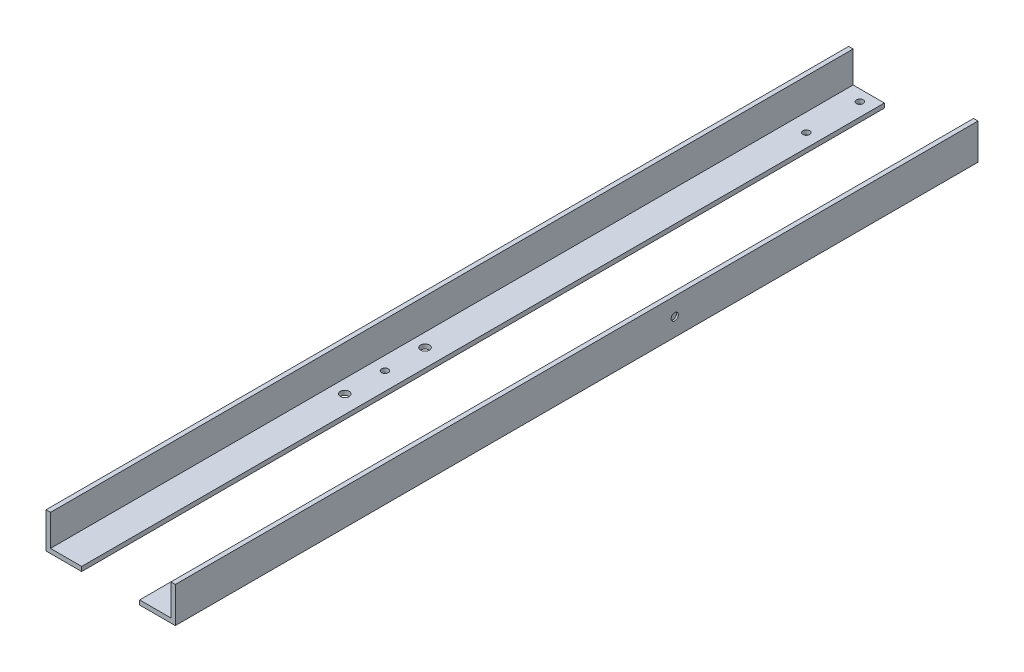
ISO-10303-21;
HEADER;
FILE_DESCRIPTION(('STEP AP214'),'2;1');
FILE_NAME('part.step','',(''),(''),'','','');
FILE_SCHEMA(('AUTOMOTIVE_DESIGN { 1 0 10303 214 1 1 1 1 }'));
ENDSEC;
DATA;
#1=APPLICATION_CONTEXT('core data for automotive mechanical design processes');
#2=APPLICATION_PROTOCOL_DEFINITION('international standard','automotive_design',2000,#1);
#3=PRODUCT_CONTEXT('',#1,'mechanical');
#4=PRODUCT('Part','Part','',(#3));
#5=PRODUCT_RELATED_PRODUCT_CATEGORY('part','',(#4));
#6=PRODUCT_DEFINITION_FORMATION('','',#4);
#7=PRODUCT_DEFINITION_CONTEXT('part definition',#1,'design');
#8=PRODUCT_DEFINITION('design','',#6,#7);
#9=PRODUCT_DEFINITION_SHAPE('','',#8);
#10=(LENGTH_UNIT() NAMED_UNIT(*) SI_UNIT(.MILLI.,.METRE.));
#11=(NAMED_UNIT(*) PLANE_ANGLE_UNIT() SI_UNIT($,.RADIAN.));
#12=(NAMED_UNIT(*) SI_UNIT($,.STERADIAN.) SOLID_ANGLE_UNIT());
#13=UNCERTAINTY_MEASURE_WITH_UNIT(LENGTH_MEASURE(1.E-05),#10,'distance_accuracy_value','');
#14=(GEOMETRIC_REPRESENTATION_CONTEXT(3) GLOBAL_UNCERTAINTY_ASSIGNED_CONTEXT((#13)) GLOBAL_UNIT_ASSIGNED_CONTEXT((#10,
#11,#12)) REPRESENTATION_CONTEXT('',''));
#15=CARTESIAN_POINT('',(0.,0.,0.));
#16=DIRECTION('',(0.,0.,1.));
#17=DIRECTION('',(1.,0.,0.));
#18=AXIS2_PLACEMENT_3D('',#15,#16,#17);
#19=CARTESIAN_POINT('',(-92.075,50.8,-571.5));
#20=DIRECTION('',(0.,0.,1.));
#21=DIRECTION('',(1.,0.,0.));
#22=AXIS2_PLACEMENT_3D('',#19,#20,#21);
#23=PLANE('',#22);
#24=DIRECTION('',(1.,0.,0.));
#25=VECTOR('',#24,1.);
#26=CARTESIAN_POINT('',(41.275,6.35,-571.5));
#27=LINE('',#26,#25);
#28=CARTESIAN_POINT('',(41.275,6.35,-571.5));
#29=VERTEX_POINT('',#28);
#30=CARTESIAN_POINT('',(85.725,6.35,-571.5));
#31=VERTEX_POINT('',#30);
#32=EDGE_CURVE('E141',#29,#31,#27,.T.);
#33=ORIENTED_EDGE('',*,*,#32,.T.);
#34=DIRECTION('',(0.,1.,0.));
#35=VECTOR('',#34,1.);
#36=CARTESIAN_POINT('',(85.725,50.8,-571.5));
#37=LINE('',#36,#35);
#38=CARTESIAN_POINT('',(85.725,50.8,-571.5));
#39=VERTEX_POINT('',#38);
#40=EDGE_CURVE('E137',#31,#39,#37,.T.);
#41=ORIENTED_EDGE('',*,*,#40,.T.);
#42=DIRECTION('',(-1.,0.,0.));
#43=VECTOR('',#42,1.);
#44=CARTESIAN_POINT('',(-92.075,50.8,-571.5));
#45=LINE('',#44,#43);
#46=CARTESIAN_POINT('',(92.075,50.8,-571.5));
#47=VERTEX_POINT('',#46);
#48=EDGE_CURVE('E116',#47,#39,#45,.T.);
#49=ORIENTED_EDGE('',*,*,#48,.F.);
#50=DIRECTION('',(0.,-1.,0.));
#51=VECTOR('',#50,1.);
#52=CARTESIAN_POINT('',(92.075,50.8,-571.5));
#53=LINE('',#52,#51);
#54=CARTESIAN_POINT('',(92.075,0.,-571.5));
#55=VERTEX_POINT('',#54);
#56=EDGE_CURVE('E140',#47,#55,#53,.T.);
#57=ORIENTED_EDGE('',*,*,#56,.T.);
#58=DIRECTION('',(-1.,0.,0.));
#59=VECTOR('',#58,1.);
#60=CARTESIAN_POINT('',(-92.075,0.,-571.5));
#61=LINE('',#60,#59);
#62=CARTESIAN_POINT('',(41.275,0.,-571.5));
#63=VERTEX_POINT('',#62);
#64=EDGE_CURVE('E48',#55,#63,#61,.T.);
#65=ORIENTED_EDGE('',*,*,#64,.T.);
#66=DIRECTION('',(0.,1.,0.));
#67=VECTOR('',#66,1.);
#68=CARTESIAN_POINT('',(41.275,6.35,-571.5));
#69=LINE('',#68,#67);
#70=EDGE_CURVE('E109',#63,#29,#69,.T.);
#71=ORIENTED_EDGE('',*,*,#70,.T.);
#72=EDGE_LOOP('',(#33,#41,#49,#57,#65,#71));
#73=FACE_BOUND('',#72,.T.);
#74=ADVANCED_FACE('F45',(#73),#23,.F.);
#75=CARTESIAN_POINT('',(-92.075,50.8,571.5));
#76=DIRECTION('',(0.,0.,-1.));
#77=DIRECTION('',(-1.,0.,0.));
#78=AXIS2_PLACEMENT_3D('',#75,#76,#77);
#79=PLANE('',#78);
#80=DIRECTION('',(1.,0.,0.));
#81=VECTOR('',#80,1.);
#82=CARTESIAN_POINT('',(-92.075,50.8,571.5));
#83=LINE('',#82,#81);
#84=CARTESIAN_POINT('',(85.725,50.8,571.5));
#85=VERTEX_POINT('',#84);
#86=CARTESIAN_POINT('',(92.075,50.8,571.5));
#87=VERTEX_POINT('',#86);
#88=EDGE_CURVE('E125',#85,#87,#83,.T.);
#89=ORIENTED_EDGE('',*,*,#88,.F.);
#90=DIRECTION('',(0.,1.,0.));
#91=VECTOR('',#90,1.);
#92=CARTESIAN_POINT('',(85.725,50.8,571.5));
#93=LINE('',#92,#91);
#94=CARTESIAN_POINT('',(85.725,6.35,571.5));
#95=VERTEX_POINT('',#94);
#96=EDGE_CURVE('E124',#95,#85,#93,.T.);
#97=ORIENTED_EDGE('',*,*,#96,.F.);
#98=DIRECTION('',(1.,0.,0.));
#99=VECTOR('',#98,1.);
#100=CARTESIAN_POINT('',(41.275,6.35,571.5));
#101=LINE('',#100,#99);
#102=CARTESIAN_POINT('',(41.275,6.35,571.5));
#103=VERTEX_POINT('',#102);
#104=EDGE_CURVE('E129',#103,#95,#101,.T.);
#105=ORIENTED_EDGE('',*,*,#104,.F.);
#106=DIRECTION('',(0.,1.,0.));
#107=VECTOR('',#106,1.);
#108=CARTESIAN_POINT('',(41.275,6.35,571.5));
#109=LINE('',#108,#107);
#110=CARTESIAN_POINT('',(41.275,0.,571.5));
#111=VERTEX_POINT('',#110);
#112=EDGE_CURVE('E54',#111,#103,#109,.T.);
#113=ORIENTED_EDGE('',*,*,#112,.F.);
#114=DIRECTION('',(1.,0.,0.));
#115=VECTOR('',#114,1.);
#116=CARTESIAN_POINT('',(-92.075,0.,571.5));
#117=LINE('',#116,#115);
#118=CARTESIAN_POINT('',(92.075,0.,571.5));
#119=VERTEX_POINT('',#118);
#120=EDGE_CURVE('E99',#111,#119,#117,.T.);
#121=ORIENTED_EDGE('',*,*,#120,.T.);
#122=DIRECTION('',(0.,-1.,0.));
#123=VECTOR('',#122,1.);
#124=CARTESIAN_POINT('',(92.075,50.8,571.5));
#125=LINE('',#124,#123);
#126=EDGE_CURVE('E103',#87,#119,#125,.T.);
#127=ORIENTED_EDGE('',*,*,#126,.F.);
#128=EDGE_LOOP('',(#89,#97,#105,#113,#121,#127));
#129=FACE_BOUND('',#128,.T.);
#130=ADVANCED_FACE('F102',(#129),#79,.F.);
#131=CARTESIAN_POINT('',(0.,0.,0.));
#132=DIRECTION('',(0.,-1.,0.));
#133=DIRECTION('',(0.,0.,-1.));
#134=AXIS2_PLACEMENT_3D('',#131,#132,#133);
#135=PLANE('',#134);
#136=CARTESIAN_POINT('',(60.325,0.,-555.625));
#137=DIRECTION('',(0.,1.,0.));
#138=DIRECTION('',(0.,0.,1.));
#139=AXIS2_PLACEMENT_3D('',#136,#137,#138);
#140=CIRCLE('',#139,4.76250000000001);
#141=CARTESIAN_POINT('',(60.325,0.,-550.8625));
#142=VERTEX_POINT('',#141);
#143=EDGE_CURVE('E144',#142,#142,#140,.T.);
#144=ORIENTED_EDGE('',*,*,#143,.T.);
#145=EDGE_LOOP('',(#144));
#146=FACE_BOUND('',#145,.T.);
#147=CARTESIAN_POINT('',(60.325,0.,-479.425));
#148=DIRECTION('',(0.,1.,0.));
#149=DIRECTION('',(0.,0.,1.));
#150=AXIS2_PLACEMENT_3D('',#147,#148,#149);
#151=CIRCLE('',#150,4.7625);
#152=CARTESIAN_POINT('',(60.325,0.,-474.6625));
#153=VERTEX_POINT('',#152);
#154=EDGE_CURVE('E290',#153,#153,#151,.T.);
#155=ORIENTED_EDGE('',*,*,#154,.T.);
#156=EDGE_LOOP('',(#155));
#157=FACE_BOUND('',#156,.T.);
#158=CARTESIAN_POINT('',(60.325,0.,114.3));
#159=DIRECTION('',(0.,1.,0.));
#160=DIRECTION('',(0.,0.,1.));
#161=AXIS2_PLACEMENT_3D('',#158,#159,#160);
#162=CIRCLE('',#161,4.7625);
#163=CARTESIAN_POINT('',(60.325,0.,119.0625));
#164=VERTEX_POINT('',#163);
#165=EDGE_CURVE('E296',#164,#164,#162,.T.);
#166=ORIENTED_EDGE('',*,*,#165,.T.);
#167=EDGE_LOOP('',(#166));
#168=FACE_BOUND('',#167,.T.);
#169=CARTESIAN_POINT('',(60.325,0.,57.15));
#170=DIRECTION('',(0.,1.,0.));
#171=DIRECTION('',(0.,0.,1.));
#172=AXIS2_PLACEMENT_3D('',#169,#170,#171);
#173=CIRCLE('',#172,6.35);
#174=CARTESIAN_POINT('',(60.325,0.,63.5));
#175=VERTEX_POINT('',#174);
#176=EDGE_CURVE('E302',#175,#175,#173,.T.);
#177=ORIENTED_EDGE('',*,*,#176,.T.);
#178=EDGE_LOOP('',(#177));
#179=FACE_BOUND('',#178,.T.);
#180=CARTESIAN_POINT('',(60.325,0.,171.45));
#181=DIRECTION('',(0.,1.,0.));
#182=DIRECTION('',(0.,0.,1.));
#183=AXIS2_PLACEMENT_3D('',#180,#181,#182);
#184=CIRCLE('',#183,6.34999999999999);
#185=CARTESIAN_POINT('',(60.325,0.,177.8));
#186=VERTEX_POINT('',#185);
#187=EDGE_CURVE('E280',#186,#186,#184,.T.);
#188=ORIENTED_EDGE('',*,*,#187,.T.);
#189=EDGE_LOOP('',(#188));
#190=FACE_BOUND('',#189,.T.);
#191=DIRECTION('',(0.,0.,1.));
#192=VECTOR('',#191,1.);
#193=CARTESIAN_POINT('',(41.275,0.,-571.5));
#194=LINE('',#193,#192);
#195=EDGE_CURVE('E12',#63,#111,#194,.T.);
#196=ORIENTED_EDGE('',*,*,#195,.F.);
#197=ORIENTED_EDGE('',*,*,#64,.F.);
#198=DIRECTION('',(0.,0.,-1.));
#199=VECTOR('',#198,1.);
#200=CARTESIAN_POINT('',(92.075,0.,571.5));
#201=LINE('',#200,#199);
#202=EDGE_CURVE('E108',#119,#55,#201,.T.);
#203=ORIENTED_EDGE('',*,*,#202,.F.);
#204=ORIENTED_EDGE('',*,*,#120,.F.);
#205=EDGE_LOOP('',(#196,#197,#203,#204));
#206=FACE_BOUND('',#205,.T.);
#207=ADVANCED_FACE('F118',(#146,#157,#168,#179,#190,#206),#135,.T.);
#208=CARTESIAN_POINT('',(92.075,50.8,571.5));
#209=DIRECTION('',(-1.,0.,0.));
#210=DIRECTION('',(0.,0.,1.));
#211=AXIS2_PLACEMENT_3D('',#208,#209,#210);
#212=PLANE('',#211);
#213=CARTESIAN_POINT('',(92.075,25.4,-139.7));
#214=DIRECTION('',(1.,0.,0.));
#215=DIRECTION('',(0.,0.,-1.));
#216=AXIS2_PLACEMENT_3D('',#213,#214,#215);
#217=CIRCLE('',#216,5.13079999999997);
#218=CARTESIAN_POINT('',(92.075,25.4,-144.8308));
#219=VERTEX_POINT('',#218);
#220=EDGE_CURVE('E277',#219,#219,#217,.T.);
#221=ORIENTED_EDGE('',*,*,#220,.F.);
#222=EDGE_LOOP('',(#221));
#223=FACE_BOUND('',#222,.T.);
#224=ORIENTED_EDGE('',*,*,#202,.T.);
#225=ORIENTED_EDGE('',*,*,#56,.F.);
#226=DIRECTION('',(0.,0.,-1.));
#227=VECTOR('',#226,1.);
#228=CARTESIAN_POINT('',(92.075,50.8,571.5));
#229=LINE('',#228,#227);
#230=EDGE_CURVE('E115',#87,#47,#229,.T.);
#231=ORIENTED_EDGE('',*,*,#230,.F.);
#232=ORIENTED_EDGE('',*,*,#126,.T.);
#233=EDGE_LOOP('',(#224,#225,#231,#232));
#234=FACE_BOUND('',#233,.T.);
#235=ADVANCED_FACE('F112',(#223,#234),#212,.F.);
#236=CARTESIAN_POINT('',(0.,50.8,0.));
#237=DIRECTION('',(0.,-1.,0.));
#238=DIRECTION('',(0.,0.,-1.));
#239=AXIS2_PLACEMENT_3D('',#236,#237,#238);
#240=PLANE('',#239);
#241=ORIENTED_EDGE('',*,*,#48,.T.);
#242=DIRECTION('',(0.,0.,1.));
#243=VECTOR('',#242,1.);
#244=CARTESIAN_POINT('',(85.725,50.8,-571.5));
#245=LINE('',#244,#243);
#246=EDGE_CURVE('E131',#39,#85,#245,.T.);
#247=ORIENTED_EDGE('',*,*,#246,.T.);
#248=ORIENTED_EDGE('',*,*,#88,.T.);
#249=ORIENTED_EDGE('',*,*,#230,.T.);
#250=EDGE_LOOP('',(#241,#247,#248,#249));
#251=FACE_BOUND('',#250,.T.);
#252=ADVANCED_FACE('F150',(#251),#240,.F.);
#253=CARTESIAN_POINT('',(85.725,50.8,-571.5));
#254=DIRECTION('',(1.,0.,0.));
#255=DIRECTION('',(0.,1.,0.));
#256=AXIS2_PLACEMENT_3D('',#253,#254,#255);
#257=PLANE('',#256);
#258=ORIENTED_EDGE('',*,*,#96,.T.);
#259=ORIENTED_EDGE('',*,*,#246,.F.);
#260=ORIENTED_EDGE('',*,*,#40,.F.);
#261=DIRECTION('',(0.,0.,1.));
#262=VECTOR('',#261,1.);
#263=CARTESIAN_POINT('',(85.725,6.35,-571.5));
#264=LINE('',#263,#262);
#265=EDGE_CURVE('E78',#31,#95,#264,.T.);
#266=ORIENTED_EDGE('',*,*,#265,.T.);
#267=EDGE_LOOP('',(#258,#259,#260,#266));
#268=FACE_BOUND('',#267,.T.);
#269=ADVANCED_FACE('F152',(#268),#257,.F.);
#270=CARTESIAN_POINT('',(41.275,6.35,-571.5));
#271=DIRECTION('',(0.,-1.,0.));
#272=DIRECTION('',(0.,0.,-1.));
#273=AXIS2_PLACEMENT_3D('',#270,#271,#272);
#274=PLANE('',#273);
#275=CARTESIAN_POINT('',(60.325,6.35,-555.625));
#276=DIRECTION('',(0.,1.,0.));
#277=DIRECTION('',(0.,0.,1.));
#278=AXIS2_PLACEMENT_3D('',#275,#276,#277);
#279=CIRCLE('',#278,4.76250000000001);
#280=CARTESIAN_POINT('',(60.325,6.35,-550.8625));
#281=VERTEX_POINT('',#280);
#282=EDGE_CURVE('E287',#281,#281,#279,.T.);
#283=ORIENTED_EDGE('',*,*,#282,.F.);
#284=EDGE_LOOP('',(#283));
#285=FACE_BOUND('',#284,.T.);
#286=CARTESIAN_POINT('',(60.325,6.35,-479.425));
#287=DIRECTION('',(0.,1.,0.));
#288=DIRECTION('',(0.,0.,1.));
#289=AXIS2_PLACEMENT_3D('',#286,#287,#288);
#290=CIRCLE('',#289,4.7625);
#291=CARTESIAN_POINT('',(60.325,6.35,-474.6625));
#292=VERTEX_POINT('',#291);
#293=EDGE_CURVE('E293',#292,#292,#290,.T.);
#294=ORIENTED_EDGE('',*,*,#293,.F.);
#295=EDGE_LOOP('',(#294));
#296=FACE_BOUND('',#295,.T.);
#297=CARTESIAN_POINT('',(60.325,6.35,114.3));
#298=DIRECTION('',(0.,1.,0.));
#299=DIRECTION('',(0.,0.,1.));
#300=AXIS2_PLACEMENT_3D('',#297,#298,#299);
#301=CIRCLE('',#300,4.7625);
#302=CARTESIAN_POINT('',(60.325,6.35,119.0625));
#303=VERTEX_POINT('',#302);
#304=EDGE_CURVE('E299',#303,#303,#301,.T.);
#305=ORIENTED_EDGE('',*,*,#304,.F.);
#306=EDGE_LOOP('',(#305));
#307=FACE_BOUND('',#306,.T.);
#308=CARTESIAN_POINT('',(60.325,6.35,57.15));
#309=DIRECTION('',(0.,1.,0.));
#310=DIRECTION('',(0.,0.,1.));
#311=AXIS2_PLACEMENT_3D('',#308,#309,#310);
#312=CIRCLE('',#311,6.35);
#313=CARTESIAN_POINT('',(60.325,6.35,63.5));
#314=VERTEX_POINT('',#313);
#315=EDGE_CURVE('E305',#314,#314,#312,.T.);
#316=ORIENTED_EDGE('',*,*,#315,.F.);
#317=EDGE_LOOP('',(#316));
#318=FACE_BOUND('',#317,.T.);
#319=CARTESIAN_POINT('',(60.325,6.35,171.45));
#320=DIRECTION('',(0.,1.,0.));
#321=DIRECTION('',(0.,0.,1.));
#322=AXIS2_PLACEMENT_3D('',#319,#320,#321);
#323=CIRCLE('',#322,6.34999999999999);
#324=CARTESIAN_POINT('',(60.325,6.35,177.8));
#325=VERTEX_POINT('',#324);
#326=EDGE_CURVE('E276',#325,#325,#323,.T.);
#327=ORIENTED_EDGE('',*,*,#326,.F.);
#328=EDGE_LOOP('',(#327));
#329=FACE_BOUND('',#328,.T.);
#330=ORIENTED_EDGE('',*,*,#104,.T.);
#331=ORIENTED_EDGE('',*,*,#265,.F.);
#332=ORIENTED_EDGE('',*,*,#32,.F.);
#333=DIRECTION('',(0.,0.,1.));
#334=VECTOR('',#333,1.);
#335=CARTESIAN_POINT('',(41.275,6.35,-571.5));
#336=LINE('',#335,#334);
#337=EDGE_CURVE('E127',#29,#103,#336,.T.);
#338=ORIENTED_EDGE('',*,*,#337,.T.);
#339=EDGE_LOOP('',(#330,#331,#332,#338));
#340=FACE_BOUND('',#339,.T.);
#341=ADVANCED_FACE('F154',(#285,#296,#307,#318,#329,#340),#274,.F.);
#342=CARTESIAN_POINT('',(41.275,6.35,-571.5));
#343=DIRECTION('',(1.,0.,0.));
#344=DIRECTION('',(0.,0.,-1.));
#345=AXIS2_PLACEMENT_3D('',#342,#343,#344);
#346=PLANE('',#345);
#347=ORIENTED_EDGE('',*,*,#112,.T.);
#348=ORIENTED_EDGE('',*,*,#337,.F.);
#349=ORIENTED_EDGE('',*,*,#70,.F.);
#350=ORIENTED_EDGE('',*,*,#195,.T.);
#351=EDGE_LOOP('',(#347,#348,#349,#350));
#352=FACE_BOUND('',#351,.T.);
#353=ADVANCED_FACE('F156',(#352),#346,.F.);
#354=CARTESIAN_POINT('',(60.325,0.,171.45));
#355=DIRECTION('',(0.,1.,0.));
#356=DIRECTION('',(0.,0.,1.));
#357=AXIS2_PLACEMENT_3D('',#354,#355,#356);
#358=CYLINDRICAL_SURFACE('',#357,6.34999999999999);
#359=ORIENTED_EDGE('',*,*,#187,.F.);
#360=EDGE_LOOP('',(#359));
#361=FACE_BOUND('',#360,.T.);
#362=ORIENTED_EDGE('',*,*,#326,.T.);
#363=EDGE_LOOP('',(#362));
#364=FACE_BOUND('',#363,.T.);
#365=ADVANCED_FACE('F158',(#361,#364),#358,.F.);
#366=CARTESIAN_POINT('',(60.325,0.,57.15));
#367=DIRECTION('',(0.,1.,0.));
#368=DIRECTION('',(0.,0.,1.));
#369=AXIS2_PLACEMENT_3D('',#366,#367,#368);
#370=CYLINDRICAL_SURFACE('',#369,6.35);
#371=ORIENTED_EDGE('',*,*,#176,.F.);
#372=EDGE_LOOP('',(#371));
#373=FACE_BOUND('',#372,.T.);
#374=ORIENTED_EDGE('',*,*,#315,.T.);
#375=EDGE_LOOP('',(#374));
#376=FACE_BOUND('',#375,.T.);
#377=ADVANCED_FACE('F164',(#373,#376),#370,.F.);
#378=CARTESIAN_POINT('',(60.325,0.,114.3));
#379=DIRECTION('',(0.,1.,0.));
#380=DIRECTION('',(0.,0.,1.));
#381=AXIS2_PLACEMENT_3D('',#378,#379,#380);
#382=CYLINDRICAL_SURFACE('',#381,4.7625);
#383=ORIENTED_EDGE('',*,*,#165,.F.);
#384=EDGE_LOOP('',(#383));
#385=FACE_BOUND('',#384,.T.);
#386=ORIENTED_EDGE('',*,*,#304,.T.);
#387=EDGE_LOOP('',(#386));
#388=FACE_BOUND('',#387,.T.);
#389=ADVANCED_FACE('F211',(#385,#388),#382,.F.);
#390=CARTESIAN_POINT('',(60.325,0.,-479.425));
#391=DIRECTION('',(0.,1.,0.));
#392=DIRECTION('',(0.,0.,1.));
#393=AXIS2_PLACEMENT_3D('',#390,#391,#392);
#394=CYLINDRICAL_SURFACE('',#393,4.7625);
#395=ORIENTED_EDGE('',*,*,#154,.F.);
#396=EDGE_LOOP('',(#395));
#397=FACE_BOUND('',#396,.T.);
#398=ORIENTED_EDGE('',*,*,#293,.T.);
#399=EDGE_LOOP('',(#398));
#400=FACE_BOUND('',#399,.T.);
#401=ADVANCED_FACE('F221',(#397,#400),#394,.F.);
#402=CARTESIAN_POINT('',(60.325,0.,-555.625));
#403=DIRECTION('',(0.,1.,0.));
#404=DIRECTION('',(0.,0.,1.));
#405=AXIS2_PLACEMENT_3D('',#402,#403,#404);
#406=CYLINDRICAL_SURFACE('',#405,4.76250000000001);
#407=ORIENTED_EDGE('',*,*,#143,.F.);
#408=EDGE_LOOP('',(#407));
#409=FACE_BOUND('',#408,.T.);
#410=ORIENTED_EDGE('',*,*,#282,.T.);
#411=EDGE_LOOP('',(#410));
#412=FACE_BOUND('',#411,.T.);
#413=ADVANCED_FACE('F231',(#409,#412),#406,.F.);
#414=CARTESIAN_POINT('',(89.535,25.4,-139.7));
#415=DIRECTION('',(1.,0.,0.));
#416=DIRECTION('',(0.,0.,-1.));
#417=AXIS2_PLACEMENT_3D('',#414,#415,#416);
#418=CYLINDRICAL_SURFACE('',#417,5.13079999999997);
#419=CARTESIAN_POINT('',(89.535,25.4,-139.7));
#420=DIRECTION('',(1.,0.,0.));
#421=DIRECTION('',(0.,0.,-1.));
#422=AXIS2_PLACEMENT_3D('',#419,#420,#421);
#423=CIRCLE('',#422,5.13079999999997);
#424=CARTESIAN_POINT('',(89.535,25.4,-144.8308));
#425=VERTEX_POINT('',#424);
#426=EDGE_CURVE('E275',#425,#425,#423,.T.);
#427=ORIENTED_EDGE('',*,*,#426,.F.);
#428=EDGE_LOOP('',(#427));
#429=FACE_BOUND('',#428,.T.);
#430=ORIENTED_EDGE('',*,*,#220,.T.);
#431=EDGE_LOOP('',(#430));
#432=FACE_BOUND('',#431,.T.);
#433=ADVANCED_FACE('F241',(#429,#432),#418,.F.);
#434=CARTESIAN_POINT('',(89.535,25.4,-139.7));
#435=DIRECTION('',(1.,0.,0.));
#436=DIRECTION('',(0.,0.,-1.));
#437=AXIS2_PLACEMENT_3D('',#434,#435,#436);
#438=PLANE('',#437);
#439=ORIENTED_EDGE('',*,*,#426,.T.);
#440=EDGE_LOOP('',(#439));
#441=FACE_BOUND('',#440,.T.);
#442=ADVANCED_FACE('F259',(#441),#438,.T.);
#443=CLOSED_SHELL('',(#74,#130,#207,#235,#252,#269,#341,#353,#365,#377,#389,#401,#413,#433,#442));
#444=MANIFOLD_SOLID_BREP('B2',#443);
#445=CARTESIAN_POINT('',(-92.075,50.8,571.5));
#446=DIRECTION('',(1.,0.,0.));
#447=DIRECTION('',(0.,0.,-1.));
#448=AXIS2_PLACEMENT_3D('',#445,#446,#447);
#449=PLANE('',#448);
#450=DIRECTION('',(0.,0.,1.));
#451=VECTOR('',#450,1.);
#452=CARTESIAN_POINT('',(-92.075,0.,571.5));
#453=LINE('',#452,#451);
#454=CARTESIAN_POINT('',(-92.075,0.,-571.5));
#455=VERTEX_POINT('',#454);
#456=CARTESIAN_POINT('',(-92.075,0.,571.5));
#457=VERTEX_POINT('',#456);
#458=EDGE_CURVE('E392',#455,#457,#453,.T.);
#459=ORIENTED_EDGE('',*,*,#458,.T.);
#460=DIRECTION('',(0.,-1.,0.));
#461=VECTOR('',#460,1.);
#462=CARTESIAN_POINT('',(-92.075,50.8,571.5));
#463=LINE('',#462,#461);
#464=CARTESIAN_POINT('',(-92.075,50.8,571.5));
#465=VERTEX_POINT('',#464);
#466=EDGE_CURVE('E364',#465,#457,#463,.T.);
#467=ORIENTED_EDGE('',*,*,#466,.F.);
#468=DIRECTION('',(0.,0.,1.));
#469=VECTOR('',#468,1.);
#470=CARTESIAN_POINT('',(-92.075,50.8,571.5));
#471=LINE('',#470,#469);
#472=CARTESIAN_POINT('',(-92.075,50.8,-571.5));
#473=VERTEX_POINT('',#472);
#474=EDGE_CURVE('E380',#473,#465,#471,.T.);
#475=ORIENTED_EDGE('',*,*,#474,.F.);
#476=DIRECTION('',(0.,-1.,0.));
#477=VECTOR('',#476,1.);
#478=CARTESIAN_POINT('',(-92.075,50.8,-571.5));
#479=LINE('',#478,#477);
#480=EDGE_CURVE('E43',#473,#455,#479,.T.);
#481=ORIENTED_EDGE('',*,*,#480,.T.);
#482=EDGE_LOOP('',(#459,#467,#475,#481));
#483=FACE_BOUND('',#482,.T.);
#484=ADVANCED_FACE('F356',(#483),#449,.F.);
#485=CARTESIAN_POINT('',(0.,0.,0.));
#486=DIRECTION('',(0.,-1.,0.));
#487=DIRECTION('',(0.,0.,-1.));
#488=AXIS2_PLACEMENT_3D('',#485,#486,#487);
#489=PLANE('',#488);
#490=CARTESIAN_POINT('',(-60.325,0.,-555.625));
#491=DIRECTION('',(0.,1.,0.));
#492=DIRECTION('',(0.,0.,1.));
#493=AXIS2_PLACEMENT_3D('',#490,#491,#492);
#494=CIRCLE('',#493,4.76250000000002);
#495=CARTESIAN_POINT('',(-60.325,0.,-550.8625));
#496=VERTEX_POINT('',#495);
#497=EDGE_CURVE('E435',#496,#496,#494,.T.);
#498=ORIENTED_EDGE('',*,*,#497,.T.);
#499=EDGE_LOOP('',(#498));
#500=FACE_BOUND('',#499,.T.);
#501=CARTESIAN_POINT('',(-60.325,0.,-479.425));
#502=DIRECTION('',(0.,1.,0.));
#503=DIRECTION('',(0.,0.,1.));
#504=AXIS2_PLACEMENT_3D('',#501,#502,#503);
#505=CIRCLE('',#504,4.7625);
#506=CARTESIAN_POINT('',(-60.325,0.,-474.6625));
#507=VERTEX_POINT('',#506);
#508=EDGE_CURVE('E464',#507,#507,#505,.T.);
#509=ORIENTED_EDGE('',*,*,#508,.T.);
#510=EDGE_LOOP('',(#509));
#511=FACE_BOUND('',#510,.T.);
#512=CARTESIAN_POINT('',(-66.675,0.,114.3));
#513=DIRECTION('',(0.,1.,0.));
#514=DIRECTION('',(0.,0.,1.));
#515=AXIS2_PLACEMENT_3D('',#512,#513,#514);
#516=CIRCLE('',#515,4.7625);
#517=CARTESIAN_POINT('',(-66.675,0.,119.0625));
#518=VERTEX_POINT('',#517);
#519=EDGE_CURVE('E458',#518,#518,#516,.T.);
#520=ORIENTED_EDGE('',*,*,#519,.T.);
#521=EDGE_LOOP('',(#520));
#522=FACE_BOUND('',#521,.T.);
#523=CARTESIAN_POINT('',(-66.675,0.,57.15));
#524=DIRECTION('',(0.,1.,0.));
#525=DIRECTION('',(0.,0.,1.));
#526=AXIS2_PLACEMENT_3D('',#523,#524,#525);
#527=CIRCLE('',#526,6.35);
#528=CARTESIAN_POINT('',(-66.675,0.,63.5));
#529=VERTEX_POINT('',#528);
#530=EDGE_CURVE('E452',#529,#529,#527,.T.);
#531=ORIENTED_EDGE('',*,*,#530,.T.);
#532=EDGE_LOOP('',(#531));
#533=FACE_BOUND('',#532,.T.);
#534=CARTESIAN_POINT('',(-66.675,0.,171.45));
#535=DIRECTION('',(0.,1.,0.));
#536=DIRECTION('',(0.,0.,1.));
#537=AXIS2_PLACEMENT_3D('',#534,#535,#536);
#538=CIRCLE('',#537,6.35);
#539=CARTESIAN_POINT('',(-66.675,0.,177.8));
#540=VERTEX_POINT('',#539);
#541=EDGE_CURVE('E446',#540,#540,#538,.T.);
#542=ORIENTED_EDGE('',*,*,#541,.T.);
#543=EDGE_LOOP('',(#542));
#544=FACE_BOUND('',#543,.T.);
#545=DIRECTION('',(0.,0.,1.));
#546=VECTOR('',#545,1.);
#547=CARTESIAN_POINT('',(-41.275,0.,-571.5));
#548=LINE('',#547,#546);
#549=CARTESIAN_POINT('',(-41.275,0.,-571.5));
#550=VERTEX_POINT('',#549);
#551=CARTESIAN_POINT('',(-41.275,0.,571.5));
#552=VERTEX_POINT('',#551);
#553=EDGE_CURVE('E409',#550,#552,#548,.T.);
#554=ORIENTED_EDGE('',*,*,#553,.T.);
#555=DIRECTION('',(1.,0.,0.));
#556=VECTOR('',#555,1.);
#557=CARTESIAN_POINT('',(-92.075,0.,571.5));
#558=LINE('',#557,#556);
#559=EDGE_CURVE('E399',#457,#552,#558,.T.);
#560=ORIENTED_EDGE('',*,*,#559,.F.);
#561=ORIENTED_EDGE('',*,*,#458,.F.);
#562=DIRECTION('',(-1.,0.,0.));
#563=VECTOR('',#562,1.);
#564=CARTESIAN_POINT('',(-92.075,0.,-571.5));
#565=LINE('',#564,#563);
#566=EDGE_CURVE('E400',#550,#455,#565,.T.);
#567=ORIENTED_EDGE('',*,*,#566,.F.);
#568=EDGE_LOOP('',(#554,#560,#561,#567));
#569=FACE_BOUND('',#568,.T.);
#570=ADVANCED_FACE('F408',(#500,#511,#522,#533,#544,#569),#489,.T.);
#571=CARTESIAN_POINT('',(0.,50.8,0.));
#572=DIRECTION('',(0.,-1.,0.));
#573=DIRECTION('',(0.,0.,-1.));
#574=AXIS2_PLACEMENT_3D('',#571,#572,#573);
#575=PLANE('',#574);
#576=DIRECTION('',(1.,0.,0.));
#577=VECTOR('',#576,1.);
#578=CARTESIAN_POINT('',(-92.075,50.8,571.5));
#579=LINE('',#578,#577);
#580=CARTESIAN_POINT('',(-85.725,50.8,571.5));
#581=VERTEX_POINT('',#580);
#582=EDGE_CURVE('E407',#465,#581,#579,.T.);
#583=ORIENTED_EDGE('',*,*,#582,.T.);
#584=DIRECTION('',(0.,0.,1.));
#585=VECTOR('',#584,1.);
#586=CARTESIAN_POINT('',(-85.725,50.8,-571.5));
#587=LINE('',#586,#585);
#588=CARTESIAN_POINT('',(-85.725,50.8,-571.5));
#589=VERTEX_POINT('',#588);
#590=EDGE_CURVE('E415',#589,#581,#587,.T.);
#591=ORIENTED_EDGE('',*,*,#590,.F.);
#592=DIRECTION('',(-1.,0.,0.));
#593=VECTOR('',#592,1.);
#594=CARTESIAN_POINT('',(-92.075,50.8,-571.5));
#595=LINE('',#594,#593);
#596=EDGE_CURVE('E410',#589,#473,#595,.T.);
#597=ORIENTED_EDGE('',*,*,#596,.T.);
#598=ORIENTED_EDGE('',*,*,#474,.T.);
#599=EDGE_LOOP('',(#583,#591,#597,#598));
#600=FACE_BOUND('',#599,.T.);
#601=ADVANCED_FACE('F517',(#600),#575,.F.);
#602=CARTESIAN_POINT('',(-92.075,50.8,571.5));
#603=DIRECTION('',(0.,0.,-1.));
#604=DIRECTION('',(-1.,0.,0.));
#605=AXIS2_PLACEMENT_3D('',#602,#603,#604);
#606=PLANE('',#605);
#607=DIRECTION('',(1.,0.,0.));
#608=VECTOR('',#607,1.);
#609=CARTESIAN_POINT('',(-85.725,6.35,571.5));
#610=LINE('',#609,#608);
#611=CARTESIAN_POINT('',(-85.725,6.35,571.5));
#612=VERTEX_POINT('',#611);
#613=CARTESIAN_POINT('',(-41.275,6.35,571.5));
#614=VERTEX_POINT('',#613);
#615=EDGE_CURVE('E429',#612,#614,#610,.T.);
#616=ORIENTED_EDGE('',*,*,#615,.F.);
#617=DIRECTION('',(0.,-1.,0.));
#618=VECTOR('',#617,1.);
#619=CARTESIAN_POINT('',(-85.725,50.8,571.5));
#620=LINE('',#619,#618);
#621=EDGE_CURVE('E432',#581,#612,#620,.T.);
#622=ORIENTED_EDGE('',*,*,#621,.F.);
#623=ORIENTED_EDGE('',*,*,#582,.F.);
#624=ORIENTED_EDGE('',*,*,#466,.T.);
#625=ORIENTED_EDGE('',*,*,#559,.T.);
#626=DIRECTION('',(0.,-1.,0.));
#627=VECTOR('',#626,1.);
#628=CARTESIAN_POINT('',(-41.275,6.35,571.5));
#629=LINE('',#628,#627);
#630=EDGE_CURVE('E371',#614,#552,#629,.T.);
#631=ORIENTED_EDGE('',*,*,#630,.F.);
#632=EDGE_LOOP('',(#616,#622,#623,#624,#625,#631));
#633=FACE_BOUND('',#632,.T.);
#634=ADVANCED_FACE('F405',(#633),#606,.F.);
#635=CARTESIAN_POINT('',(-92.075,50.8,-571.5));
#636=DIRECTION('',(0.,0.,1.));
#637=DIRECTION('',(1.,0.,0.));
#638=AXIS2_PLACEMENT_3D('',#635,#636,#637);
#639=PLANE('',#638);
#640=ORIENTED_EDGE('',*,*,#596,.F.);
#641=DIRECTION('',(0.,-1.,0.));
#642=VECTOR('',#641,1.);
#643=CARTESIAN_POINT('',(-85.725,50.8,-571.5));
#644=LINE('',#643,#642);
#645=CARTESIAN_POINT('',(-85.725,6.35,-571.5));
#646=VERTEX_POINT('',#645);
#647=EDGE_CURVE('E428',#589,#646,#644,.T.);
#648=ORIENTED_EDGE('',*,*,#647,.T.);
#649=DIRECTION('',(1.,0.,0.));
#650=VECTOR('',#649,1.);
#651=CARTESIAN_POINT('',(-85.725,6.35,-571.5));
#652=LINE('',#651,#650);
#653=CARTESIAN_POINT('',(-41.275,6.35,-571.5));
#654=VERTEX_POINT('',#653);
#655=EDGE_CURVE('E438',#646,#654,#652,.T.);
#656=ORIENTED_EDGE('',*,*,#655,.T.);
#657=DIRECTION('',(0.,-1.,0.));
#658=VECTOR('',#657,1.);
#659=CARTESIAN_POINT('',(-41.275,6.35,-571.5));
#660=LINE('',#659,#658);
#661=EDGE_CURVE('E422',#654,#550,#660,.T.);
#662=ORIENTED_EDGE('',*,*,#661,.T.);
#663=ORIENTED_EDGE('',*,*,#566,.T.);
#664=ORIENTED_EDGE('',*,*,#480,.F.);
#665=EDGE_LOOP('',(#640,#648,#656,#662,#663,#664));
#666=FACE_BOUND('',#665,.T.);
#667=ADVANCED_FACE('F358',(#666),#639,.F.);
#668=CARTESIAN_POINT('',(-41.275,6.35,-571.5));
#669=DIRECTION('',(-1.,0.,0.));
#670=DIRECTION('',(0.,0.,1.));
#671=AXIS2_PLACEMENT_3D('',#668,#669,#670);
#672=PLANE('',#671);
#673=ORIENTED_EDGE('',*,*,#630,.T.);
#674=ORIENTED_EDGE('',*,*,#553,.F.);
#675=ORIENTED_EDGE('',*,*,#661,.F.);
#676=DIRECTION('',(0.,0.,1.));
#677=VECTOR('',#676,1.);
#678=CARTESIAN_POINT('',(-41.275,6.35,-571.5));
#679=LINE('',#678,#677);
#680=EDGE_CURVE('E421',#654,#614,#679,.T.);
#681=ORIENTED_EDGE('',*,*,#680,.T.);
#682=EDGE_LOOP('',(#673,#674,#675,#681));
#683=FACE_BOUND('',#682,.T.);
#684=ADVANCED_FACE('F518',(#683),#672,.F.);
#685=CARTESIAN_POINT('',(-85.725,50.8,-571.5));
#686=DIRECTION('',(-1.,0.,0.));
#687=DIRECTION('',(0.,0.,1.));
#688=AXIS2_PLACEMENT_3D('',#685,#686,#687);
#689=PLANE('',#688);
#690=ORIENTED_EDGE('',*,*,#621,.T.);
#691=DIRECTION('',(0.,0.,1.));
#692=VECTOR('',#691,1.);
#693=CARTESIAN_POINT('',(-85.725,6.35,-571.5));
#694=LINE('',#693,#692);
#695=EDGE_CURVE('E418',#646,#612,#694,.T.);
#696=ORIENTED_EDGE('',*,*,#695,.F.);
#697=ORIENTED_EDGE('',*,*,#647,.F.);
#698=ORIENTED_EDGE('',*,*,#590,.T.);
#699=EDGE_LOOP('',(#690,#696,#697,#698));
#700=FACE_BOUND('',#699,.T.);
#701=ADVANCED_FACE('F486',(#700),#689,.F.);
#702=CARTESIAN_POINT('',(-85.725,6.35,-571.5));
#703=DIRECTION('',(0.,-1.,0.));
#704=DIRECTION('',(0.,0.,-1.));
#705=AXIS2_PLACEMENT_3D('',#702,#703,#704);
#706=PLANE('',#705);
#707=CARTESIAN_POINT('',(-60.325,6.35,-555.625));
#708=DIRECTION('',(0.,1.,0.));
#709=DIRECTION('',(0.,0.,1.));
#710=AXIS2_PLACEMENT_3D('',#707,#708,#709);
#711=CIRCLE('',#710,4.76250000000002);
#712=CARTESIAN_POINT('',(-60.325,6.35,-550.8625));
#713=VERTEX_POINT('',#712);
#714=EDGE_CURVE('E467',#713,#713,#711,.T.);
#715=ORIENTED_EDGE('',*,*,#714,.F.);
#716=EDGE_LOOP('',(#715));
#717=FACE_BOUND('',#716,.T.);
#718=CARTESIAN_POINT('',(-60.325,6.35,-479.425));
#719=DIRECTION('',(0.,1.,0.));
#720=DIRECTION('',(0.,0.,1.));
#721=AXIS2_PLACEMENT_3D('',#718,#719,#720);
#722=CIRCLE('',#721,4.7625);
#723=CARTESIAN_POINT('',(-60.325,6.35,-474.6625));
#724=VERTEX_POINT('',#723);
#725=EDGE_CURVE('E461',#724,#724,#722,.T.);
#726=ORIENTED_EDGE('',*,*,#725,.F.);
#727=EDGE_LOOP('',(#726));
#728=FACE_BOUND('',#727,.T.);
#729=CARTESIAN_POINT('',(-66.675,6.35,114.3));
#730=DIRECTION('',(0.,1.,0.));
#731=DIRECTION('',(0.,0.,1.));
#732=AXIS2_PLACEMENT_3D('',#729,#730,#731);
#733=CIRCLE('',#732,4.7625);
#734=CARTESIAN_POINT('',(-66.675,6.35,119.0625));
#735=VERTEX_POINT('',#734);
#736=EDGE_CURVE('E455',#735,#735,#733,.T.);
#737=ORIENTED_EDGE('',*,*,#736,.F.);
#738=EDGE_LOOP('',(#737));
#739=FACE_BOUND('',#738,.T.);
#740=CARTESIAN_POINT('',(-66.675,6.35,57.15));
#741=DIRECTION('',(0.,1.,0.));
#742=DIRECTION('',(0.,0.,1.));
#743=AXIS2_PLACEMENT_3D('',#740,#741,#742);
#744=CIRCLE('',#743,6.35);
#745=CARTESIAN_POINT('',(-66.675,6.35,63.5));
#746=VERTEX_POINT('',#745);
#747=EDGE_CURVE('E449',#746,#746,#744,.T.);
#748=ORIENTED_EDGE('',*,*,#747,.F.);
#749=EDGE_LOOP('',(#748));
#750=FACE_BOUND('',#749,.T.);
#751=CARTESIAN_POINT('',(-66.675,6.35,171.45));
#752=DIRECTION('',(0.,1.,0.));
#753=DIRECTION('',(0.,0.,1.));
#754=AXIS2_PLACEMENT_3D('',#751,#752,#753);
#755=CIRCLE('',#754,6.35);
#756=CARTESIAN_POINT('',(-66.675,6.35,177.8));
#757=VERTEX_POINT('',#756);
#758=EDGE_CURVE('E443',#757,#757,#755,.T.);
#759=ORIENTED_EDGE('',*,*,#758,.F.);
#760=EDGE_LOOP('',(#759));
#761=FACE_BOUND('',#760,.T.);
#762=ORIENTED_EDGE('',*,*,#615,.T.);
#763=ORIENTED_EDGE('',*,*,#680,.F.);
#764=ORIENTED_EDGE('',*,*,#655,.F.);
#765=ORIENTED_EDGE('',*,*,#695,.T.);
#766=EDGE_LOOP('',(#762,#763,#764,#765));
#767=FACE_BOUND('',#766,.T.);
#768=ADVANCED_FACE('F482',(#717,#728,#739,#750,#761,#767),#706,.F.);
#769=CARTESIAN_POINT('',(-66.675,0.,171.45));
#770=DIRECTION('',(0.,1.,0.));
#771=DIRECTION('',(0.,0.,1.));
#772=AXIS2_PLACEMENT_3D('',#769,#770,#771);
#773=CYLINDRICAL_SURFACE('',#772,6.35);
#774=ORIENTED_EDGE('',*,*,#541,.F.);
#775=EDGE_LOOP('',(#774));
#776=FACE_BOUND('',#775,.T.);
#777=ORIENTED_EDGE('',*,*,#758,.T.);
#778=EDGE_LOOP('',(#777));
#779=FACE_BOUND('',#778,.T.);
#780=ADVANCED_FACE('F485',(#776,#779),#773,.F.);
#781=CARTESIAN_POINT('',(-66.675,0.,57.15));
#782=DIRECTION('',(0.,1.,0.));
#783=DIRECTION('',(0.,0.,1.));
#784=AXIS2_PLACEMENT_3D('',#781,#782,#783);
#785=CYLINDRICAL_SURFACE('',#784,6.35);
#786=ORIENTED_EDGE('',*,*,#530,.F.);
#787=EDGE_LOOP('',(#786));
#788=FACE_BOUND('',#787,.T.);
#789=ORIENTED_EDGE('',*,*,#747,.T.);
#790=EDGE_LOOP('',(#789));
#791=FACE_BOUND('',#790,.T.);
#792=ADVANCED_FACE('F578',(#788,#791),#785,.F.);
#793=CARTESIAN_POINT('',(-66.675,0.,114.3));
#794=DIRECTION('',(0.,1.,0.));
#795=DIRECTION('',(0.,0.,1.));
#796=AXIS2_PLACEMENT_3D('',#793,#794,#795);
#797=CYLINDRICAL_SURFACE('',#796,4.7625);
#798=ORIENTED_EDGE('',*,*,#519,.F.);
#799=EDGE_LOOP('',(#798));
#800=FACE_BOUND('',#799,.T.);
#801=ORIENTED_EDGE('',*,*,#736,.T.);
#802=EDGE_LOOP('',(#801));
#803=FACE_BOUND('',#802,.T.);
#804=ADVANCED_FACE('F587',(#800,#803),#797,.F.);
#805=CARTESIAN_POINT('',(-60.325,0.,-479.425));
#806=DIRECTION('',(0.,1.,0.));
#807=DIRECTION('',(0.,0.,1.));
#808=AXIS2_PLACEMENT_3D('',#805,#806,#807);
#809=CYLINDRICAL_SURFACE('',#808,4.7625);
#810=ORIENTED_EDGE('',*,*,#508,.F.);
#811=EDGE_LOOP('',(#810));
#812=FACE_BOUND('',#811,.T.);
#813=ORIENTED_EDGE('',*,*,#725,.T.);
#814=EDGE_LOOP('',(#813));
#815=FACE_BOUND('',#814,.T.);
#816=ADVANCED_FACE('F478',(#812,#815),#809,.F.);
#817=CARTESIAN_POINT('',(-60.325,0.,-555.625));
#818=DIRECTION('',(0.,1.,0.));
#819=DIRECTION('',(0.,0.,1.));
#820=AXIS2_PLACEMENT_3D('',#817,#818,#819);
#821=CYLINDRICAL_SURFACE('',#820,4.76250000000002);
#822=ORIENTED_EDGE('',*,*,#497,.F.);
#823=EDGE_LOOP('',(#822));
#824=FACE_BOUND('',#823,.T.);
#825=ORIENTED_EDGE('',*,*,#714,.T.);
#826=EDGE_LOOP('',(#825));
#827=FACE_BOUND('',#826,.T.);
#828=ADVANCED_FACE('F475',(#824,#827),#821,.F.);
#829=CLOSED_SHELL('',(#484,#570,#601,#634,#667,#684,#701,#768,#780,#792,#804,#816,#828));
#830=MANIFOLD_SOLID_BREP('B6',#829);
#831=ADVANCED_BREP_SHAPE_REPRESENTATION('',(#18,#444,#830),#14);
#832=SHAPE_DEFINITION_REPRESENTATION(#9,#831);
ENDSEC;
END-ISO-10303-21;
